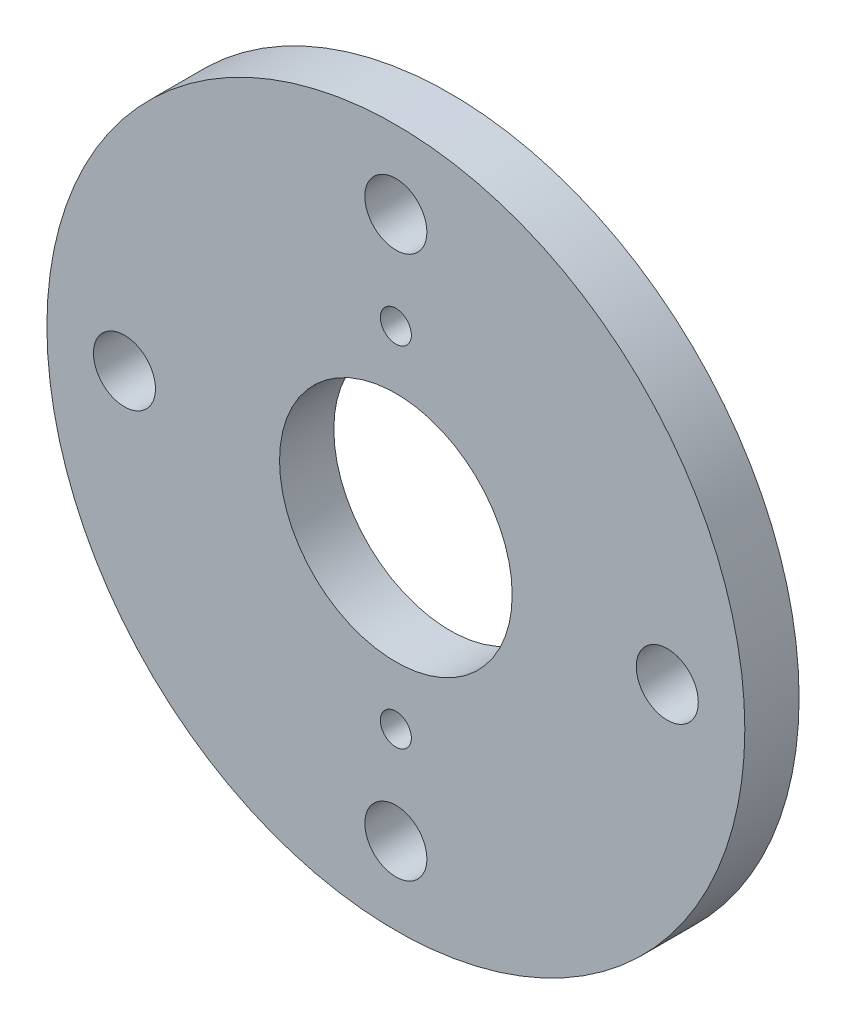
ISO-10303-21;
HEADER;
FILE_DESCRIPTION(('STEP AP214'),'2;1');
FILE_NAME('part.step','',(''),(''),'','','');
FILE_SCHEMA(('AUTOMOTIVE_DESIGN { 1 0 10303 214 1 1 1 1 }'));
ENDSEC;
DATA;
#1=APPLICATION_CONTEXT('core data for automotive mechanical design processes');
#2=APPLICATION_PROTOCOL_DEFINITION('international standard','automotive_design',2000,#1);
#3=PRODUCT_CONTEXT('',#1,'mechanical');
#4=PRODUCT('Part','Part','',(#3));
#5=PRODUCT_RELATED_PRODUCT_CATEGORY('part','',(#4));
#6=PRODUCT_DEFINITION_FORMATION('','',#4);
#7=PRODUCT_DEFINITION_CONTEXT('part definition',#1,'design');
#8=PRODUCT_DEFINITION('design','',#6,#7);
#9=PRODUCT_DEFINITION_SHAPE('','',#8);
#10=(LENGTH_UNIT() NAMED_UNIT(*) SI_UNIT(.MILLI.,.METRE.));
#11=(NAMED_UNIT(*) PLANE_ANGLE_UNIT() SI_UNIT($,.RADIAN.));
#12=(NAMED_UNIT(*) SI_UNIT($,.STERADIAN.) SOLID_ANGLE_UNIT());
#13=UNCERTAINTY_MEASURE_WITH_UNIT(LENGTH_MEASURE(1.E-05),#10,'distance_accuracy_value','');
#14=(GEOMETRIC_REPRESENTATION_CONTEXT(3) GLOBAL_UNCERTAINTY_ASSIGNED_CONTEXT((#13)) GLOBAL_UNIT_ASSIGNED_CONTEXT((#10,
#11,#12)) REPRESENTATION_CONTEXT('',''));
#15=CARTESIAN_POINT('',(0.,0.,0.));
#16=DIRECTION('',(0.,0.,1.));
#17=DIRECTION('',(1.,0.,0.));
#18=AXIS2_PLACEMENT_3D('',#15,#16,#17);
#19=CARTESIAN_POINT('',(0.,0.,7.));
#20=DIRECTION('',(0.,0.,-1.));
#21=DIRECTION('',(-1.,0.,0.));
#22=AXIS2_PLACEMENT_3D('',#19,#20,#21);
#23=CYLINDRICAL_SURFACE('',#22,45.);
#24=CARTESIAN_POINT('',(0.,0.,7.));
#25=DIRECTION('',(0.,0.,1.));
#26=DIRECTION('',(1.,0.,0.));
#27=AXIS2_PLACEMENT_3D('',#24,#25,#26);
#28=CIRCLE('',#27,45.);
#29=CARTESIAN_POINT('',(45.,0.,7.));
#30=VERTEX_POINT('',#29);
#31=EDGE_CURVE('E11',#30,#30,#28,.T.);
#32=ORIENTED_EDGE('',*,*,#31,.F.);
#33=EDGE_LOOP('',(#32));
#34=FACE_BOUND('',#33,.T.);
#35=CARTESIAN_POINT('',(0.,0.,0.));
#36=DIRECTION('',(0.,0.,1.));
#37=DIRECTION('',(1.,0.,0.));
#38=AXIS2_PLACEMENT_3D('',#35,#36,#37);
#39=CIRCLE('',#38,45.);
#40=CARTESIAN_POINT('',(45.,0.,0.));
#41=VERTEX_POINT('',#40);
#42=EDGE_CURVE('E45',#41,#41,#39,.T.);
#43=ORIENTED_EDGE('',*,*,#42,.T.);
#44=EDGE_LOOP('',(#43));
#45=FACE_BOUND('',#44,.T.);
#46=ADVANCED_FACE('F42',(#34,#45),#23,.T.);
#47=CARTESIAN_POINT('',(0.,0.,7.));
#48=DIRECTION('',(0.,0.,1.));
#49=DIRECTION('',(1.,0.,0.));
#50=AXIS2_PLACEMENT_3D('',#47,#48,#49);
#51=PLANE('',#50);
#52=CARTESIAN_POINT('',(0.,-22.5,7.));
#53=DIRECTION('',(0.,0.,1.));
#54=DIRECTION('',(1.,0.,0.));
#55=AXIS2_PLACEMENT_3D('',#52,#53,#54);
#56=CIRCLE('',#55,2.);
#57=CARTESIAN_POINT('',(2.00000000000001,-22.5,7.));
#58=VERTEX_POINT('',#57);
#59=EDGE_CURVE('E90',#58,#58,#56,.T.);
#60=ORIENTED_EDGE('',*,*,#59,.F.);
#61=EDGE_LOOP('',(#60));
#62=FACE_BOUND('',#61,.T.);
#63=CARTESIAN_POINT('',(0.,22.5,7.));
#64=DIRECTION('',(0.,0.,1.));
#65=DIRECTION('',(1.,0.,0.));
#66=AXIS2_PLACEMENT_3D('',#63,#64,#65);
#67=CIRCLE('',#66,2.);
#68=CARTESIAN_POINT('',(1.99999999999999,22.5,7.));
#69=VERTEX_POINT('',#68);
#70=EDGE_CURVE('E87',#69,#69,#67,.T.);
#71=ORIENTED_EDGE('',*,*,#70,.F.);
#72=EDGE_LOOP('',(#71));
#73=FACE_BOUND('',#72,.T.);
#74=CARTESIAN_POINT('',(0.,35.,7.));
#75=DIRECTION('',(0.,0.,1.));
#76=DIRECTION('',(1.,0.,0.));
#77=AXIS2_PLACEMENT_3D('',#74,#75,#76);
#78=CIRCLE('',#77,4.);
#79=CARTESIAN_POINT('',(4.,35.,7.));
#80=VERTEX_POINT('',#79);
#81=EDGE_CURVE('E79',#80,#80,#78,.T.);
#82=ORIENTED_EDGE('',*,*,#81,.F.);
#83=EDGE_LOOP('',(#82));
#84=FACE_BOUND('',#83,.T.);
#85=CARTESIAN_POINT('',(35.0000000000047,0.,7.));
#86=DIRECTION('',(0.,0.,1.));
#87=DIRECTION('',(1.,0.,0.));
#88=AXIS2_PLACEMENT_3D('',#85,#86,#87);
#89=CIRCLE('',#88,4.);
#90=CARTESIAN_POINT('',(39.0000000000047,0.,7.));
#91=VERTEX_POINT('',#90);
#92=EDGE_CURVE('E73',#91,#91,#89,.T.);
#93=ORIENTED_EDGE('',*,*,#92,.F.);
#94=EDGE_LOOP('',(#93));
#95=FACE_BOUND('',#94,.T.);
#96=CARTESIAN_POINT('',(4.66722296722298E-12,-35.0000000000047,7.));
#97=DIRECTION('',(0.,0.,1.));
#98=DIRECTION('',(1.,0.,0.));
#99=AXIS2_PLACEMENT_3D('',#96,#97,#98);
#100=CIRCLE('',#99,4.);
#101=CARTESIAN_POINT('',(4.00000000000467,-35.0000000000047,7.));
#102=VERTEX_POINT('',#101);
#103=EDGE_CURVE('E67',#102,#102,#100,.T.);
#104=ORIENTED_EDGE('',*,*,#103,.F.);
#105=EDGE_LOOP('',(#104));
#106=FACE_BOUND('',#105,.T.);
#107=CARTESIAN_POINT('',(-35.,-4.65599780952237E-12,7.));
#108=DIRECTION('',(0.,0.,1.));
#109=DIRECTION('',(1.,0.,0.));
#110=AXIS2_PLACEMENT_3D('',#107,#108,#109);
#111=CIRCLE('',#110,4.);
#112=CARTESIAN_POINT('',(-31.,-4.65599780952237E-12,7.));
#113=VERTEX_POINT('',#112);
#114=EDGE_CURVE('E60',#113,#113,#111,.T.);
#115=ORIENTED_EDGE('',*,*,#114,.F.);
#116=EDGE_LOOP('',(#115));
#117=FACE_BOUND('',#116,.T.);
#118=CARTESIAN_POINT('',(0.,0.,7.));
#119=DIRECTION('',(0.,0.,1.));
#120=DIRECTION('',(1.,0.,0.));
#121=AXIS2_PLACEMENT_3D('',#118,#119,#120);
#122=CIRCLE('',#121,15.);
#123=CARTESIAN_POINT('',(15.,0.,7.));
#124=VERTEX_POINT('',#123);
#125=EDGE_CURVE('E54',#124,#124,#122,.T.);
#126=ORIENTED_EDGE('',*,*,#125,.F.);
#127=EDGE_LOOP('',(#126));
#128=FACE_BOUND('',#127,.T.);
#129=ORIENTED_EDGE('',*,*,#31,.T.);
#130=EDGE_LOOP('',(#129));
#131=FACE_BOUND('',#130,.T.);
#132=ADVANCED_FACE('F106',(#62,#73,#84,#95,#106,#117,#128,#131),#51,.T.);
#133=CARTESIAN_POINT('',(0.,0.,0.));
#134=DIRECTION('',(0.,0.,1.));
#135=DIRECTION('',(1.,0.,0.));
#136=AXIS2_PLACEMENT_3D('',#133,#134,#135);
#137=PLANE('',#136);
#138=CARTESIAN_POINT('',(0.,-22.5,0.));
#139=DIRECTION('',(0.,0.,1.));
#140=DIRECTION('',(1.,0.,0.));
#141=AXIS2_PLACEMENT_3D('',#138,#139,#140);
#142=CIRCLE('',#141,2.);
#143=CARTESIAN_POINT('',(2.00000000000001,-22.5,0.));
#144=VERTEX_POINT('',#143);
#145=EDGE_CURVE('E64',#144,#144,#142,.T.);
#146=ORIENTED_EDGE('',*,*,#145,.T.);
#147=EDGE_LOOP('',(#146));
#148=FACE_BOUND('',#147,.T.);
#149=CARTESIAN_POINT('',(0.,22.5,0.));
#150=DIRECTION('',(0.,0.,1.));
#151=DIRECTION('',(1.,0.,0.));
#152=AXIS2_PLACEMENT_3D('',#149,#150,#151);
#153=CIRCLE('',#152,2.);
#154=CARTESIAN_POINT('',(1.99999999999999,22.5,0.));
#155=VERTEX_POINT('',#154);
#156=EDGE_CURVE('E84',#155,#155,#153,.T.);
#157=ORIENTED_EDGE('',*,*,#156,.T.);
#158=EDGE_LOOP('',(#157));
#159=FACE_BOUND('',#158,.T.);
#160=CARTESIAN_POINT('',(0.,35.,0.));
#161=DIRECTION('',(0.,0.,1.));
#162=DIRECTION('',(1.,0.,0.));
#163=AXIS2_PLACEMENT_3D('',#160,#161,#162);
#164=CIRCLE('',#163,4.);
#165=CARTESIAN_POINT('',(4.,35.,0.));
#166=VERTEX_POINT('',#165);
#167=EDGE_CURVE('E57',#166,#166,#164,.T.);
#168=ORIENTED_EDGE('',*,*,#167,.T.);
#169=EDGE_LOOP('',(#168));
#170=FACE_BOUND('',#169,.T.);
#171=CARTESIAN_POINT('',(35.0000000000047,0.,0.));
#172=DIRECTION('',(0.,0.,1.));
#173=DIRECTION('',(1.,0.,0.));
#174=AXIS2_PLACEMENT_3D('',#171,#172,#173);
#175=CIRCLE('',#174,4.);
#176=CARTESIAN_POINT('',(39.0000000000047,0.,0.));
#177=VERTEX_POINT('',#176);
#178=EDGE_CURVE('E76',#177,#177,#175,.T.);
#179=ORIENTED_EDGE('',*,*,#178,.T.);
#180=EDGE_LOOP('',(#179));
#181=FACE_BOUND('',#180,.T.);
#182=CARTESIAN_POINT('',(4.66722296722298E-12,-35.0000000000047,0.));
#183=DIRECTION('',(0.,0.,1.));
#184=DIRECTION('',(1.,0.,0.));
#185=AXIS2_PLACEMENT_3D('',#182,#183,#184);
#186=CIRCLE('',#185,4.);
#187=CARTESIAN_POINT('',(4.00000000000467,-35.0000000000047,0.));
#188=VERTEX_POINT('',#187);
#189=EDGE_CURVE('E70',#188,#188,#186,.T.);
#190=ORIENTED_EDGE('',*,*,#189,.T.);
#191=EDGE_LOOP('',(#190));
#192=FACE_BOUND('',#191,.T.);
#193=CARTESIAN_POINT('',(-35.,-4.65599780952237E-12,0.));
#194=DIRECTION('',(0.,0.,1.));
#195=DIRECTION('',(1.,0.,0.));
#196=AXIS2_PLACEMENT_3D('',#193,#194,#195);
#197=CIRCLE('',#196,4.);
#198=CARTESIAN_POINT('',(-31.,-4.65599780952237E-12,0.));
#199=VERTEX_POINT('',#198);
#200=EDGE_CURVE('E63',#199,#199,#197,.T.);
#201=ORIENTED_EDGE('',*,*,#200,.T.);
#202=EDGE_LOOP('',(#201));
#203=FACE_BOUND('',#202,.T.);
#204=CARTESIAN_POINT('',(0.,0.,0.));
#205=DIRECTION('',(0.,0.,1.));
#206=DIRECTION('',(1.,0.,0.));
#207=AXIS2_PLACEMENT_3D('',#204,#205,#206);
#208=CIRCLE('',#207,15.);
#209=CARTESIAN_POINT('',(15.,0.,0.));
#210=VERTEX_POINT('',#209);
#211=EDGE_CURVE('E52',#210,#210,#208,.T.);
#212=ORIENTED_EDGE('',*,*,#211,.T.);
#213=EDGE_LOOP('',(#212));
#214=FACE_BOUND('',#213,.T.);
#215=ORIENTED_EDGE('',*,*,#42,.F.);
#216=EDGE_LOOP('',(#215));
#217=FACE_BOUND('',#216,.T.);
#218=ADVANCED_FACE('F96',(#148,#159,#170,#181,#192,#203,#214,#217),#137,.F.);
#219=CARTESIAN_POINT('',(0.,0.,0.));
#220=DIRECTION('',(0.,0.,1.));
#221=DIRECTION('',(1.,0.,0.));
#222=AXIS2_PLACEMENT_3D('',#219,#220,#221);
#223=CYLINDRICAL_SURFACE('',#222,15.);
#224=ORIENTED_EDGE('',*,*,#211,.F.);
#225=EDGE_LOOP('',(#224));
#226=FACE_BOUND('',#225,.T.);
#227=ORIENTED_EDGE('',*,*,#125,.T.);
#228=EDGE_LOOP('',(#227));
#229=FACE_BOUND('',#228,.T.);
#230=ADVANCED_FACE('F122',(#226,#229),#223,.F.);
#231=CARTESIAN_POINT('',(-35.,-4.65599780952237E-12,0.));
#232=DIRECTION('',(0.,0.,1.));
#233=DIRECTION('',(1.,0.,0.));
#234=AXIS2_PLACEMENT_3D('',#231,#232,#233);
#235=CYLINDRICAL_SURFACE('',#234,4.);
#236=ORIENTED_EDGE('',*,*,#200,.F.);
#237=EDGE_LOOP('',(#236));
#238=FACE_BOUND('',#237,.T.);
#239=ORIENTED_EDGE('',*,*,#114,.T.);
#240=EDGE_LOOP('',(#239));
#241=FACE_BOUND('',#240,.T.);
#242=ADVANCED_FACE('F124',(#238,#241),#235,.F.);
#243=CARTESIAN_POINT('',(4.66722296722298E-12,-35.0000000000047,0.));
#244=DIRECTION('',(0.,0.,1.));
#245=DIRECTION('',(1.,0.,0.));
#246=AXIS2_PLACEMENT_3D('',#243,#244,#245);
#247=CYLINDRICAL_SURFACE('',#246,4.);
#248=ORIENTED_EDGE('',*,*,#189,.F.);
#249=EDGE_LOOP('',(#248));
#250=FACE_BOUND('',#249,.T.);
#251=ORIENTED_EDGE('',*,*,#103,.T.);
#252=EDGE_LOOP('',(#251));
#253=FACE_BOUND('',#252,.T.);
#254=ADVANCED_FACE('F131',(#250,#253),#247,.F.);
#255=CARTESIAN_POINT('',(35.0000000000047,0.,0.));
#256=DIRECTION('',(0.,0.,1.));
#257=DIRECTION('',(1.,0.,0.));
#258=AXIS2_PLACEMENT_3D('',#255,#256,#257);
#259=CYLINDRICAL_SURFACE('',#258,4.);
#260=ORIENTED_EDGE('',*,*,#178,.F.);
#261=EDGE_LOOP('',(#260));
#262=FACE_BOUND('',#261,.T.);
#263=ORIENTED_EDGE('',*,*,#92,.T.);
#264=EDGE_LOOP('',(#263));
#265=FACE_BOUND('',#264,.T.);
#266=ADVANCED_FACE('F179',(#262,#265),#259,.F.);
#267=CARTESIAN_POINT('',(0.,35.,0.));
#268=DIRECTION('',(0.,0.,1.));
#269=DIRECTION('',(1.,0.,0.));
#270=AXIS2_PLACEMENT_3D('',#267,#268,#269);
#271=CYLINDRICAL_SURFACE('',#270,4.);
#272=ORIENTED_EDGE('',*,*,#167,.F.);
#273=EDGE_LOOP('',(#272));
#274=FACE_BOUND('',#273,.T.);
#275=ORIENTED_EDGE('',*,*,#81,.T.);
#276=EDGE_LOOP('',(#275));
#277=FACE_BOUND('',#276,.T.);
#278=ADVANCED_FACE('F161',(#274,#277),#271,.F.);
#279=CARTESIAN_POINT('',(0.,22.5,0.));
#280=DIRECTION('',(0.,0.,1.));
#281=DIRECTION('',(1.,0.,0.));
#282=AXIS2_PLACEMENT_3D('',#279,#280,#281);
#283=CYLINDRICAL_SURFACE('',#282,2.);
#284=ORIENTED_EDGE('',*,*,#156,.F.);
#285=EDGE_LOOP('',(#284));
#286=FACE_BOUND('',#285,.T.);
#287=ORIENTED_EDGE('',*,*,#70,.T.);
#288=EDGE_LOOP('',(#287));
#289=FACE_BOUND('',#288,.T.);
#290=ADVANCED_FACE('F102',(#286,#289),#283,.F.);
#291=CARTESIAN_POINT('',(0.,-22.5,0.));
#292=DIRECTION('',(0.,0.,1.));
#293=DIRECTION('',(1.,0.,0.));
#294=AXIS2_PLACEMENT_3D('',#291,#292,#293);
#295=CYLINDRICAL_SURFACE('',#294,2.);
#296=ORIENTED_EDGE('',*,*,#145,.F.);
#297=EDGE_LOOP('',(#296));
#298=FACE_BOUND('',#297,.T.);
#299=ORIENTED_EDGE('',*,*,#59,.T.);
#300=EDGE_LOOP('',(#299));
#301=FACE_BOUND('',#300,.T.);
#302=ADVANCED_FACE('F99',(#298,#301),#295,.F.);
#303=CLOSED_SHELL('',(#46,#132,#218,#230,#242,#254,#266,#278,#290,#302));
#304=MANIFOLD_SOLID_BREP('B2',#303);
#305=ADVANCED_BREP_SHAPE_REPRESENTATION('',(#18,#304),#14);
#306=SHAPE_DEFINITION_REPRESENTATION(#9,#305);
ENDSEC;
END-ISO-10303-21;
